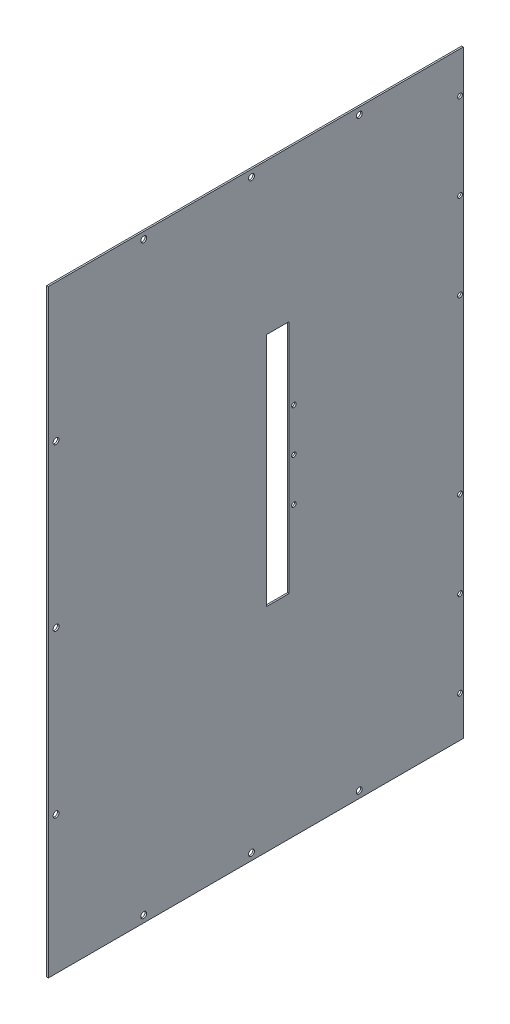
ISO-10303-21;
HEADER;
FILE_DESCRIPTION(('STEP AP214'),'2;1');
FILE_NAME('part.step','',(''),(''),'','','');
FILE_SCHEMA(('AUTOMOTIVE_DESIGN { 1 0 10303 214 1 1 1 1 }'));
ENDSEC;
DATA;
#1=APPLICATION_CONTEXT('core data for automotive mechanical design processes');
#2=APPLICATION_PROTOCOL_DEFINITION('international standard','automotive_design',2000,#1);
#3=PRODUCT_CONTEXT('',#1,'mechanical');
#4=PRODUCT('Part','Part','',(#3));
#5=PRODUCT_RELATED_PRODUCT_CATEGORY('part','',(#4));
#6=PRODUCT_DEFINITION_FORMATION('','',#4);
#7=PRODUCT_DEFINITION_CONTEXT('part definition',#1,'design');
#8=PRODUCT_DEFINITION('design','',#6,#7);
#9=PRODUCT_DEFINITION_SHAPE('','',#8);
#10=(LENGTH_UNIT() NAMED_UNIT(*) SI_UNIT(.MILLI.,.METRE.));
#11=(NAMED_UNIT(*) PLANE_ANGLE_UNIT() SI_UNIT($,.RADIAN.));
#12=(NAMED_UNIT(*) SI_UNIT($,.STERADIAN.) SOLID_ANGLE_UNIT());
#13=UNCERTAINTY_MEASURE_WITH_UNIT(LENGTH_MEASURE(1.E-05),#10,'distance_accuracy_value','');
#14=(GEOMETRIC_REPRESENTATION_CONTEXT(3) GLOBAL_UNCERTAINTY_ASSIGNED_CONTEXT((#13)) GLOBAL_UNIT_ASSIGNED_CONTEXT((#10,
#11,#12)) REPRESENTATION_CONTEXT('',''));
#15=CARTESIAN_POINT('',(0.,0.,0.));
#16=DIRECTION('',(0.,0.,1.));
#17=DIRECTION('',(1.,0.,0.));
#18=AXIS2_PLACEMENT_3D('',#15,#16,#17);
#19=CARTESIAN_POINT('',(0.,415.77191042894,0.));
#20=DIRECTION('',(0.,1.,0.));
#21=DIRECTION('',(0.,0.,1.));
#22=AXIS2_PLACEMENT_3D('',#19,#20,#21);
#23=PLANE('',#22);
#24=DIRECTION('',(1.,0.,0.));
#25=VECTOR('',#24,1.);
#26=CARTESIAN_POINT('',(0.,415.77191042894,182.444591823564));
#27=LINE('',#26,#25);
#28=CARTESIAN_POINT('',(0.,415.77191042894,182.444591823564));
#29=VERTEX_POINT('',#28);
#30=CARTESIAN_POINT('',(1.5,415.77191042894,182.444591823564));
#31=VERTEX_POINT('',#30);
#32=EDGE_CURVE('E57',#29,#31,#27,.T.);
#33=ORIENTED_EDGE('',*,*,#32,.F.);
#34=DIRECTION('',(0.,0.,-1.));
#35=VECTOR('',#34,1.);
#36=CARTESIAN_POINT('',(0.,415.77191042894,202.444591823564));
#37=LINE('',#36,#35);
#38=CARTESIAN_POINT('',(0.,415.77191042894,161.78137888322));
#39=VERTEX_POINT('',#38);
#40=EDGE_CURVE('E127',#29,#39,#37,.T.);
#41=ORIENTED_EDGE('',*,*,#40,.T.);
#42=DIRECTION('',(1.,0.,0.));
#43=VECTOR('',#42,1.);
#44=CARTESIAN_POINT('',(1.5,415.77191042894,161.78137888322));
#45=LINE('',#44,#43);
#46=CARTESIAN_POINT('',(1.5,415.77191042894,161.78137888322));
#47=VERTEX_POINT('',#46);
#48=EDGE_CURVE('E142',#39,#47,#45,.T.);
#49=ORIENTED_EDGE('',*,*,#48,.T.);
#50=DIRECTION('',(0.,0.,1.));
#51=VECTOR('',#50,1.);
#52=CARTESIAN_POINT('',(1.5,415.77191042894,202.444591823564));
#53=LINE('',#52,#51);
#54=EDGE_CURVE('E62',#47,#31,#53,.T.);
#55=ORIENTED_EDGE('',*,*,#54,.T.);
#56=EDGE_LOOP('',(#33,#41,#49,#55));
#57=FACE_BOUND('',#56,.T.);
#58=ADVANCED_FACE('F40',(#57),#23,.F.);
#59=CARTESIAN_POINT('',(0.,197.269383238865,0.));
#60=DIRECTION('',(0.,-1.,0.));
#61=DIRECTION('',(0.,0.,-1.));
#62=AXIS2_PLACEMENT_3D('',#59,#60,#61);
#63=PLANE('',#62);
#64=DIRECTION('',(-1.,0.,0.));
#65=VECTOR('',#64,1.);
#66=CARTESIAN_POINT('',(0.,197.269383238865,182.444591823564));
#67=LINE('',#66,#65);
#68=CARTESIAN_POINT('',(1.5,197.269383238865,182.444591823564));
#69=VERTEX_POINT('',#68);
#70=CARTESIAN_POINT('',(0.,197.269383238865,182.444591823564));
#71=VERTEX_POINT('',#70);
#72=EDGE_CURVE('E108',#69,#71,#67,.T.);
#73=ORIENTED_EDGE('',*,*,#72,.F.);
#74=DIRECTION('',(0.,0.,-1.));
#75=VECTOR('',#74,1.);
#76=CARTESIAN_POINT('',(1.5,197.269383238865,161.78137888322));
#77=LINE('',#76,#75);
#78=CARTESIAN_POINT('',(1.5,197.269383238865,161.78137888322));
#79=VERTEX_POINT('',#78);
#80=EDGE_CURVE('E123',#69,#79,#77,.T.);
#81=ORIENTED_EDGE('',*,*,#80,.T.);
#82=DIRECTION('',(-1.,0.,0.));
#83=VECTOR('',#82,1.);
#84=CARTESIAN_POINT('',(1.5,197.269383238865,161.78137888322));
#85=LINE('',#84,#83);
#86=CARTESIAN_POINT('',(0.,197.269383238865,161.78137888322));
#87=VERTEX_POINT('',#86);
#88=EDGE_CURVE('E111',#79,#87,#85,.T.);
#89=ORIENTED_EDGE('',*,*,#88,.T.);
#90=DIRECTION('',(0.,0.,1.));
#91=VECTOR('',#90,1.);
#92=CARTESIAN_POINT('',(0.,197.269383238865,161.78137888322));
#93=LINE('',#92,#91);
#94=EDGE_CURVE('E105',#87,#71,#93,.T.);
#95=ORIENTED_EDGE('',*,*,#94,.T.);
#96=EDGE_LOOP('',(#73,#81,#89,#95));
#97=FACE_BOUND('',#96,.T.);
#98=ADVANCED_FACE('F107',(#97),#63,.F.);
#99=CARTESIAN_POINT('',(0.,0.,161.78137888322));
#100=DIRECTION('',(0.,0.,-1.));
#101=DIRECTION('',(-1.,0.,0.));
#102=AXIS2_PLACEMENT_3D('',#99,#100,#101);
#103=PLANE('',#102);
#104=ORIENTED_EDGE('',*,*,#88,.F.);
#105=DIRECTION('',(0.,1.,0.));
#106=VECTOR('',#105,1.);
#107=CARTESIAN_POINT('',(1.5,435.77191042894,161.78137888322));
#108=LINE('',#107,#106);
#109=EDGE_CURVE('E144',#79,#47,#108,.T.);
#110=ORIENTED_EDGE('',*,*,#109,.T.);
#111=ORIENTED_EDGE('',*,*,#48,.F.);
#112=DIRECTION('',(0.,-1.,0.));
#113=VECTOR('',#112,1.);
#114=CARTESIAN_POINT('',(0.,435.77191042894,161.78137888322));
#115=LINE('',#114,#113);
#116=EDGE_CURVE('E146',#39,#87,#115,.T.);
#117=ORIENTED_EDGE('',*,*,#116,.T.);
#118=EDGE_LOOP('',(#104,#110,#111,#117));
#119=FACE_BOUND('',#118,.T.);
#120=ADVANCED_FACE('F284',(#119),#103,.F.);
#121=CARTESIAN_POINT('',(1.5,0.,385.));
#122=DIRECTION('',(-1.,0.,0.));
#123=DIRECTION('',(0.,0.,1.));
#124=AXIS2_PLACEMENT_3D('',#121,#122,#123);
#125=PLANE('',#124);
#126=CARTESIAN_POINT('',(1.5,306.533399999984,157.143238189676));
#127=DIRECTION('',(1.,0.,0.));
#128=DIRECTION('',(0.,0.,-1.));
#129=AXIS2_PLACEMENT_3D('',#126,#127,#128);
#130=CIRCLE('',#129,2.09999999999999);
#131=CARTESIAN_POINT('',(1.5,306.533399999984,155.043238189676));
#132=VERTEX_POINT('',#131);
#133=EDGE_CURVE('E213',#132,#132,#130,.T.);
#134=ORIENTED_EDGE('',*,*,#133,.F.);
#135=EDGE_LOOP('',(#134));
#136=FACE_BOUND('',#135,.T.);
#137=CARTESIAN_POINT('',(1.5,346.533399999984,157.143238189676));
#138=DIRECTION('',(1.,0.,0.));
#139=DIRECTION('',(0.,0.,-1.));
#140=AXIS2_PLACEMENT_3D('',#137,#138,#139);
#141=CIRCLE('',#140,2.09999999999999);
#142=CARTESIAN_POINT('',(1.5,346.533399999984,155.043238189676));
#143=VERTEX_POINT('',#142);
#144=EDGE_CURVE('E218',#143,#143,#141,.T.);
#145=ORIENTED_EDGE('',*,*,#144,.F.);
#146=EDGE_LOOP('',(#145));
#147=FACE_BOUND('',#146,.T.);
#148=CARTESIAN_POINT('',(1.5,266.533399999984,157.143238189676));
#149=DIRECTION('',(1.,0.,0.));
#150=DIRECTION('',(0.,0.,-1.));
#151=AXIS2_PLACEMENT_3D('',#148,#149,#150);
#152=CIRCLE('',#151,2.09999999999999);
#153=CARTESIAN_POINT('',(1.5,266.533399999984,155.043238189676));
#154=VERTEX_POINT('',#153);
#155=EDGE_CURVE('E210',#154,#154,#152,.T.);
#156=ORIENTED_EDGE('',*,*,#155,.F.);
#157=EDGE_LOOP('',(#156));
#158=FACE_BOUND('',#157,.T.);
#159=CARTESIAN_POINT('',(1.5,437.85,3.00000000000001));
#160=DIRECTION('',(-1.,0.,0.));
#161=DIRECTION('',(0.,0.,1.));
#162=AXIS2_PLACEMENT_3D('',#159,#160,#161);
#163=CIRCLE('',#162,2.25);
#164=CARTESIAN_POINT('',(1.5,437.85,5.25000000000002));
#165=VERTEX_POINT('',#164);
#166=EDGE_CURVE('E253',#165,#165,#163,.T.);
#167=ORIENTED_EDGE('',*,*,#166,.T.);
#168=EDGE_LOOP('',(#167));
#169=FACE_BOUND('',#168,.T.);
#170=CARTESIAN_POINT('',(1.5,357.85,3.00000000000002));
#171=DIRECTION('',(-1.,0.,0.));
#172=DIRECTION('',(0.,0.,1.));
#173=AXIS2_PLACEMENT_3D('',#170,#171,#172);
#174=CIRCLE('',#173,2.25000000000001);
#175=CARTESIAN_POINT('',(1.5,357.85,5.25000000000003));
#176=VERTEX_POINT('',#175);
#177=EDGE_CURVE('E250',#176,#176,#174,.T.);
#178=ORIENTED_EDGE('',*,*,#177,.T.);
#179=EDGE_LOOP('',(#178));
#180=FACE_BOUND('',#179,.T.);
#181=CARTESIAN_POINT('',(1.5,37.8500000000001,3.));
#182=DIRECTION('',(-1.,0.,0.));
#183=DIRECTION('',(0.,0.,1.));
#184=AXIS2_PLACEMENT_3D('',#181,#182,#183);
#185=CIRCLE('',#184,2.24999999999999);
#186=CARTESIAN_POINT('',(1.5,37.8500000000001,5.24999999999999));
#187=VERTEX_POINT('',#186);
#188=EDGE_CURVE('E247',#187,#187,#185,.T.);
#189=ORIENTED_EDGE('',*,*,#188,.T.);
#190=EDGE_LOOP('',(#189));
#191=FACE_BOUND('',#190,.T.);
#192=CARTESIAN_POINT('',(1.5,117.85,3.00000000000001));
#193=DIRECTION('',(-1.,0.,0.));
#194=DIRECTION('',(0.,0.,1.));
#195=AXIS2_PLACEMENT_3D('',#192,#193,#194);
#196=CIRCLE('',#195,2.25);
#197=CARTESIAN_POINT('',(1.5,117.85,5.25000000000002));
#198=VERTEX_POINT('',#197);
#199=EDGE_CURVE('E244',#198,#198,#196,.T.);
#200=ORIENTED_EDGE('',*,*,#199,.T.);
#201=EDGE_LOOP('',(#200));
#202=FACE_BOUND('',#201,.T.);
#203=CARTESIAN_POINT('',(1.5,197.85,3.00000000000002));
#204=DIRECTION('',(-1.,0.,0.));
#205=DIRECTION('',(0.,0.,1.));
#206=AXIS2_PLACEMENT_3D('',#203,#204,#205);
#207=CIRCLE('',#206,2.25000000000001);
#208=CARTESIAN_POINT('',(1.5,197.85,5.25000000000003));
#209=VERTEX_POINT('',#208);
#210=EDGE_CURVE('E230',#209,#209,#207,.T.);
#211=ORIENTED_EDGE('',*,*,#210,.T.);
#212=EDGE_LOOP('',(#211));
#213=FACE_BOUND('',#212,.T.);
#214=CARTESIAN_POINT('',(1.5,517.85,3.));
#215=DIRECTION('',(-1.,0.,0.));
#216=DIRECTION('',(0.,0.,1.));
#217=AXIS2_PLACEMENT_3D('',#214,#215,#216);
#218=CIRCLE('',#217,2.24999999999999);
#219=CARTESIAN_POINT('',(1.5,517.85,5.24999999999999));
#220=VERTEX_POINT('',#219);
#221=EDGE_CURVE('E259',#220,#220,#218,.T.);
#222=ORIENTED_EDGE('',*,*,#221,.T.);
#223=EDGE_LOOP('',(#222));
#224=FACE_BOUND('',#223,.T.);
#225=CARTESIAN_POINT('',(1.5,549.318299999998,196.5));
#226=DIRECTION('',(1.,0.,0.));
#227=DIRECTION('',(0.,0.,-1.));
#228=AXIS2_PLACEMENT_3D('',#225,#226,#227);
#229=CIRCLE('',#228,2.74999999999999);
#230=CARTESIAN_POINT('',(1.5,549.318299999998,193.75));
#231=VERTEX_POINT('',#230);
#232=EDGE_CURVE('E204',#231,#231,#229,.T.);
#233=ORIENTED_EDGE('',*,*,#232,.F.);
#234=EDGE_LOOP('',(#233));
#235=FACE_BOUND('',#234,.T.);
#236=CARTESIAN_POINT('',(1.5,549.318299999998,96.5000000000001));
#237=DIRECTION('',(1.,0.,0.));
#238=DIRECTION('',(0.,0.,-1.));
#239=AXIS2_PLACEMENT_3D('',#236,#237,#238);
#240=CIRCLE('',#239,2.74999999999995);
#241=CARTESIAN_POINT('',(1.5,549.318299999998,93.7500000000001));
#242=VERTEX_POINT('',#241);
#243=EDGE_CURVE('E262',#242,#242,#240,.T.);
#244=ORIENTED_EDGE('',*,*,#243,.F.);
#245=EDGE_LOOP('',(#244));
#246=FACE_BOUND('',#245,.T.);
#247=CARTESIAN_POINT('',(1.5,549.318299999998,296.5));
#248=DIRECTION('',(1.,0.,0.));
#249=DIRECTION('',(0.,0.,-1.));
#250=AXIS2_PLACEMENT_3D('',#247,#248,#249);
#251=CIRCLE('',#250,2.74999999999991);
#252=CARTESIAN_POINT('',(1.5,549.318299999998,293.75));
#253=VERTEX_POINT('',#252);
#254=EDGE_CURVE('E199',#253,#253,#251,.T.);
#255=ORIENTED_EDGE('',*,*,#254,.F.);
#256=EDGE_LOOP('',(#255));
#257=FACE_BOUND('',#256,.T.);
#258=CARTESIAN_POINT('',(1.5,277.848399999997,377.815462169057));
#259=DIRECTION('',(1.,0.,0.));
#260=DIRECTION('',(0.,0.,-1.));
#261=AXIS2_PLACEMENT_3D('',#258,#259,#260);
#262=CIRCLE('',#261,2.75000000000004);
#263=CARTESIAN_POINT('',(1.5,277.848399999997,375.065462169057));
#264=VERTEX_POINT('',#263);
#265=EDGE_CURVE('E192',#264,#264,#262,.T.);
#266=ORIENTED_EDGE('',*,*,#265,.F.);
#267=EDGE_LOOP('',(#266));
#268=FACE_BOUND('',#267,.T.);
#269=CARTESIAN_POINT('',(1.5,427.848399999997,377.815462169057));
#270=DIRECTION('',(1.,0.,0.));
#271=DIRECTION('',(0.,0.,-1.));
#272=AXIS2_PLACEMENT_3D('',#269,#270,#271);
#273=CIRCLE('',#272,2.74999999999993);
#274=CARTESIAN_POINT('',(1.5,427.848399999997,375.065462169057));
#275=VERTEX_POINT('',#274);
#276=EDGE_CURVE('E198',#275,#275,#273,.T.);
#277=ORIENTED_EDGE('',*,*,#276,.F.);
#278=EDGE_LOOP('',(#277));
#279=FACE_BOUND('',#278,.T.);
#280=CARTESIAN_POINT('',(1.5,127.848399999997,377.815462169058));
#281=DIRECTION('',(1.,0.,0.));
#282=DIRECTION('',(0.,0.,-1.));
#283=AXIS2_PLACEMENT_3D('',#280,#281,#282);
#284=CIRCLE('',#283,2.75000000000004);
#285=CARTESIAN_POINT('',(1.5,127.848399999997,375.065462169058));
#286=VERTEX_POINT('',#285);
#287=EDGE_CURVE('E187',#286,#286,#284,.T.);
#288=ORIENTED_EDGE('',*,*,#287,.F.);
#289=EDGE_LOOP('',(#288));
#290=FACE_BOUND('',#289,.T.);
#291=CARTESIAN_POINT('',(1.5,6.38169999999832,196.5));
#292=DIRECTION('',(1.,0.,0.));
#293=DIRECTION('',(0.,0.,-1.));
#294=AXIS2_PLACEMENT_3D('',#291,#292,#293);
#295=CIRCLE('',#294,2.75000000000001);
#296=CARTESIAN_POINT('',(1.5,6.38169999999832,193.75));
#297=VERTEX_POINT('',#296);
#298=EDGE_CURVE('E180',#297,#297,#295,.T.);
#299=ORIENTED_EDGE('',*,*,#298,.F.);
#300=EDGE_LOOP('',(#299));
#301=FACE_BOUND('',#300,.T.);
#302=CARTESIAN_POINT('',(1.5,6.38169999999831,96.5));
#303=DIRECTION('',(1.,0.,0.));
#304=DIRECTION('',(0.,0.,-1.));
#305=AXIS2_PLACEMENT_3D('',#302,#303,#304);
#306=CIRCLE('',#305,2.75000000000001);
#307=CARTESIAN_POINT('',(1.5,6.38169999999831,93.75));
#308=VERTEX_POINT('',#307);
#309=EDGE_CURVE('E186',#308,#308,#306,.T.);
#310=ORIENTED_EDGE('',*,*,#309,.F.);
#311=EDGE_LOOP('',(#310));
#312=FACE_BOUND('',#311,.T.);
#313=CARTESIAN_POINT('',(1.5,6.38169999999827,296.5));
#314=DIRECTION('',(1.,0.,0.));
#315=DIRECTION('',(0.,0.,-1.));
#316=AXIS2_PLACEMENT_3D('',#313,#314,#315);
#317=CIRCLE('',#316,2.75000000000004);
#318=CARTESIAN_POINT('',(1.5,6.38169999999827,293.75));
#319=VERTEX_POINT('',#318);
#320=EDGE_CURVE('E132',#319,#319,#317,.T.);
#321=ORIENTED_EDGE('',*,*,#320,.F.);
#322=EDGE_LOOP('',(#321));
#323=FACE_BOUND('',#322,.T.);
#324=ORIENTED_EDGE('',*,*,#109,.F.);
#325=ORIENTED_EDGE('',*,*,#80,.F.);
#326=DIRECTION('',(0.,-1.,0.));
#327=VECTOR('',#326,1.);
#328=CARTESIAN_POINT('',(1.5,415.77191042894,182.444591823564));
#329=LINE('',#328,#327);
#330=EDGE_CURVE('E122',#31,#69,#329,.T.);
#331=ORIENTED_EDGE('',*,*,#330,.F.);
#332=ORIENTED_EDGE('',*,*,#54,.F.);
#333=EDGE_LOOP('',(#324,#325,#331,#332));
#334=FACE_BOUND('',#333,.T.);
#335=DIRECTION('',(0.,1.,0.));
#336=VECTOR('',#335,1.);
#337=CARTESIAN_POINT('',(1.5,0.,0.));
#338=LINE('',#337,#336);
#339=CARTESIAN_POINT('',(1.5,0.,0.));
#340=VERTEX_POINT('',#339);
#341=CARTESIAN_POINT('',(1.5,555.7,0.));
#342=VERTEX_POINT('',#341);
#343=EDGE_CURVE('E148',#340,#342,#338,.T.);
#344=ORIENTED_EDGE('',*,*,#343,.T.);
#345=DIRECTION('',(0.,0.,-1.));
#346=VECTOR('',#345,1.);
#347=CARTESIAN_POINT('',(1.5,555.7,385.));
#348=LINE('',#347,#346);
#349=CARTESIAN_POINT('',(1.5,555.7,385.));
#350=VERTEX_POINT('',#349);
#351=EDGE_CURVE('E11',#350,#342,#348,.T.);
#352=ORIENTED_EDGE('',*,*,#351,.F.);
#353=DIRECTION('',(0.,1.,0.));
#354=VECTOR('',#353,1.);
#355=CARTESIAN_POINT('',(1.5,0.,385.));
#356=LINE('',#355,#354);
#357=CARTESIAN_POINT('',(1.5,0.,385.));
#358=VERTEX_POINT('',#357);
#359=EDGE_CURVE('E149',#358,#350,#356,.T.);
#360=ORIENTED_EDGE('',*,*,#359,.F.);
#361=DIRECTION('',(0.,0.,-1.));
#362=VECTOR('',#361,1.);
#363=CARTESIAN_POINT('',(1.5,0.,385.));
#364=LINE('',#363,#362);
#365=EDGE_CURVE('E161',#358,#340,#364,.T.);
#366=ORIENTED_EDGE('',*,*,#365,.T.);
#367=EDGE_LOOP('',(#344,#352,#360,#366));
#368=FACE_BOUND('',#367,.T.);
#369=ADVANCED_FACE('F42',(#136,#147,#158,#169,#180,#191,#202,#213,#224,#235,#246,#257,#268,#279,
#290,#301,#312,#323,#334,#368),#125,.F.);
#370=CARTESIAN_POINT('',(0.,555.7,385.));
#371=DIRECTION('',(0.,1.,0.));
#372=DIRECTION('',(0.,0.,1.));
#373=AXIS2_PLACEMENT_3D('',#370,#371,#372);
#374=PLANE('',#373);
#375=DIRECTION('',(1.,0.,0.));
#376=VECTOR('',#375,1.);
#377=CARTESIAN_POINT('',(0.,555.7,0.));
#378=LINE('',#377,#376);
#379=CARTESIAN_POINT('',(0.,555.7,0.));
#380=VERTEX_POINT('',#379);
#381=EDGE_CURVE('E164',#380,#342,#378,.T.);
#382=ORIENTED_EDGE('',*,*,#381,.F.);
#383=DIRECTION('',(0.,0.,-1.));
#384=VECTOR('',#383,1.);
#385=CARTESIAN_POINT('',(0.,555.7,385.));
#386=LINE('',#385,#384);
#387=CARTESIAN_POINT('',(0.,555.7,385.));
#388=VERTEX_POINT('',#387);
#389=EDGE_CURVE('E49',#388,#380,#386,.T.);
#390=ORIENTED_EDGE('',*,*,#389,.F.);
#391=DIRECTION('',(1.,0.,0.));
#392=VECTOR('',#391,1.);
#393=CARTESIAN_POINT('',(0.,555.7,385.));
#394=LINE('',#393,#392);
#395=EDGE_CURVE('E151',#388,#350,#394,.T.);
#396=ORIENTED_EDGE('',*,*,#395,.T.);
#397=ORIENTED_EDGE('',*,*,#351,.T.);
#398=EDGE_LOOP('',(#382,#390,#396,#397));
#399=FACE_BOUND('',#398,.T.);
#400=ADVANCED_FACE('F283',(#399),#374,.T.);
#401=CARTESIAN_POINT('',(0.,0.,385.));
#402=DIRECTION('',(-1.,0.,0.));
#403=DIRECTION('',(0.,0.,1.));
#404=AXIS2_PLACEMENT_3D('',#401,#402,#403);
#405=PLANE('',#404);
#406=CARTESIAN_POINT('',(0.,306.533399999984,157.143238189676));
#407=DIRECTION('',(-1.,0.,0.));
#408=DIRECTION('',(0.,0.,1.));
#409=AXIS2_PLACEMENT_3D('',#406,#407,#408);
#410=CIRCLE('',#409,2.09999999999999);
#411=CARTESIAN_POINT('',(0.,306.533399999984,159.243238189676));
#412=VERTEX_POINT('',#411);
#413=EDGE_CURVE('E44',#412,#412,#410,.T.);
#414=ORIENTED_EDGE('',*,*,#413,.F.);
#415=EDGE_LOOP('',(#414));
#416=FACE_BOUND('',#415,.T.);
#417=CARTESIAN_POINT('',(0.,346.533399999984,157.143238189676));
#418=DIRECTION('',(-1.,0.,0.));
#419=DIRECTION('',(0.,0.,1.));
#420=AXIS2_PLACEMENT_3D('',#417,#418,#419);
#421=CIRCLE('',#420,2.09999999999999);
#422=CARTESIAN_POINT('',(0.,346.533399999984,159.243238189676));
#423=VERTEX_POINT('',#422);
#424=EDGE_CURVE('E211',#423,#423,#421,.T.);
#425=ORIENTED_EDGE('',*,*,#424,.F.);
#426=EDGE_LOOP('',(#425));
#427=FACE_BOUND('',#426,.T.);
#428=CARTESIAN_POINT('',(0.,266.533399999984,157.143238189676));
#429=DIRECTION('',(-1.,0.,0.));
#430=DIRECTION('',(0.,0.,1.));
#431=AXIS2_PLACEMENT_3D('',#428,#429,#430);
#432=CIRCLE('',#431,2.09999999999999);
#433=CARTESIAN_POINT('',(0.,266.533399999984,159.243238189676));
#434=VERTEX_POINT('',#433);
#435=EDGE_CURVE('E207',#434,#434,#432,.T.);
#436=ORIENTED_EDGE('',*,*,#435,.F.);
#437=EDGE_LOOP('',(#436));
#438=FACE_BOUND('',#437,.T.);
#439=CARTESIAN_POINT('',(0.,437.85,3.00000000000001));
#440=DIRECTION('',(-1.,0.,0.));
#441=DIRECTION('',(0.,0.,1.));
#442=AXIS2_PLACEMENT_3D('',#439,#440,#441);
#443=CIRCLE('',#442,2.25);
#444=CARTESIAN_POINT('',(0.,437.85,5.25000000000002));
#445=VERTEX_POINT('',#444);
#446=EDGE_CURVE('E227',#445,#445,#443,.T.);
#447=ORIENTED_EDGE('',*,*,#446,.F.);
#448=EDGE_LOOP('',(#447));
#449=FACE_BOUND('',#448,.T.);
#450=CARTESIAN_POINT('',(0.,357.85,3.00000000000002));
#451=DIRECTION('',(-1.,0.,0.));
#452=DIRECTION('',(0.,0.,1.));
#453=AXIS2_PLACEMENT_3D('',#450,#451,#452);
#454=CIRCLE('',#453,2.25000000000001);
#455=CARTESIAN_POINT('',(0.,357.85,5.25000000000003));
#456=VERTEX_POINT('',#455);
#457=EDGE_CURVE('E231',#456,#456,#454,.T.);
#458=ORIENTED_EDGE('',*,*,#457,.F.);
#459=EDGE_LOOP('',(#458));
#460=FACE_BOUND('',#459,.T.);
#461=CARTESIAN_POINT('',(0.,37.8500000000001,3.));
#462=DIRECTION('',(-1.,0.,0.));
#463=DIRECTION('',(0.,0.,-1.));
#464=AXIS2_PLACEMENT_3D('',#461,#462,#463);
#465=CIRCLE('',#464,2.24999999999999);
#466=CARTESIAN_POINT('',(0.,37.8500000000001,0.750000000000018));
#467=VERTEX_POINT('',#466);
#468=EDGE_CURVE('E234',#467,#467,#465,.T.);
#469=ORIENTED_EDGE('',*,*,#468,.F.);
#470=EDGE_LOOP('',(#469));
#471=FACE_BOUND('',#470,.T.);
#472=CARTESIAN_POINT('',(0.,117.85,3.00000000000001));
#473=DIRECTION('',(-1.,0.,0.));
#474=DIRECTION('',(0.,0.,-1.));
#475=AXIS2_PLACEMENT_3D('',#472,#473,#474);
#476=CIRCLE('',#475,2.25);
#477=CARTESIAN_POINT('',(0.,117.85,0.75000000000001));
#478=VERTEX_POINT('',#477);
#479=EDGE_CURVE('E237',#478,#478,#476,.T.);
#480=ORIENTED_EDGE('',*,*,#479,.F.);
#481=EDGE_LOOP('',(#480));
#482=FACE_BOUND('',#481,.T.);
#483=CARTESIAN_POINT('',(0.,197.85,3.00000000000002));
#484=DIRECTION('',(-1.,0.,0.));
#485=DIRECTION('',(0.,0.,-1.));
#486=AXIS2_PLACEMENT_3D('',#483,#484,#485);
#487=CIRCLE('',#486,2.25000000000001);
#488=CARTESIAN_POINT('',(0.,197.85,0.750000000000019));
#489=VERTEX_POINT('',#488);
#490=EDGE_CURVE('E209',#489,#489,#487,.T.);
#491=ORIENTED_EDGE('',*,*,#490,.F.);
#492=EDGE_LOOP('',(#491));
#493=FACE_BOUND('',#492,.T.);
#494=CARTESIAN_POINT('',(0.,517.85,3.));
#495=DIRECTION('',(-1.,0.,0.));
#496=DIRECTION('',(0.,0.,1.));
#497=AXIS2_PLACEMENT_3D('',#494,#495,#496);
#498=CIRCLE('',#497,2.24999999999999);
#499=CARTESIAN_POINT('',(0.,517.85,5.24999999999999));
#500=VERTEX_POINT('',#499);
#501=EDGE_CURVE('E256',#500,#500,#498,.T.);
#502=ORIENTED_EDGE('',*,*,#501,.F.);
#503=EDGE_LOOP('',(#502));
#504=FACE_BOUND('',#503,.T.);
#505=CARTESIAN_POINT('',(0.,549.318299999998,196.5));
#506=DIRECTION('',(-1.,0.,0.));
#507=DIRECTION('',(0.,0.,1.));
#508=AXIS2_PLACEMENT_3D('',#505,#506,#507);
#509=CIRCLE('',#508,2.74999999999999);
#510=CARTESIAN_POINT('',(0.,549.318299999998,199.25));
#511=VERTEX_POINT('',#510);
#512=EDGE_CURVE('E203',#511,#511,#509,.T.);
#513=ORIENTED_EDGE('',*,*,#512,.F.);
#514=EDGE_LOOP('',(#513));
#515=FACE_BOUND('',#514,.T.);
#516=CARTESIAN_POINT('',(0.,549.318299999998,96.5000000000001));
#517=DIRECTION('',(-1.,0.,0.));
#518=DIRECTION('',(0.,0.,1.));
#519=AXIS2_PLACEMENT_3D('',#516,#517,#518);
#520=CIRCLE('',#519,2.74999999999995);
#521=CARTESIAN_POINT('',(0.,549.318299999998,99.25));
#522=VERTEX_POINT('',#521);
#523=EDGE_CURVE('E200',#522,#522,#520,.T.);
#524=ORIENTED_EDGE('',*,*,#523,.F.);
#525=EDGE_LOOP('',(#524));
#526=FACE_BOUND('',#525,.T.);
#527=CARTESIAN_POINT('',(0.,549.318299999998,296.5));
#528=DIRECTION('',(-1.,0.,0.));
#529=DIRECTION('',(0.,0.,1.));
#530=AXIS2_PLACEMENT_3D('',#527,#528,#529);
#531=CIRCLE('',#530,2.74999999999991);
#532=CARTESIAN_POINT('',(0.,549.318299999998,299.25));
#533=VERTEX_POINT('',#532);
#534=EDGE_CURVE('E195',#533,#533,#531,.T.);
#535=ORIENTED_EDGE('',*,*,#534,.F.);
#536=EDGE_LOOP('',(#535));
#537=FACE_BOUND('',#536,.T.);
#538=CARTESIAN_POINT('',(0.,277.848399999997,377.815462169057));
#539=DIRECTION('',(-1.,0.,0.));
#540=DIRECTION('',(0.,0.,1.));
#541=AXIS2_PLACEMENT_3D('',#538,#539,#540);
#542=CIRCLE('',#541,2.75000000000004);
#543=CARTESIAN_POINT('',(0.,277.848399999997,380.565462169057));
#544=VERTEX_POINT('',#543);
#545=EDGE_CURVE('E191',#544,#544,#542,.T.);
#546=ORIENTED_EDGE('',*,*,#545,.F.);
#547=EDGE_LOOP('',(#546));
#548=FACE_BOUND('',#547,.T.);
#549=CARTESIAN_POINT('',(0.,427.848399999997,377.815462169057));
#550=DIRECTION('',(-1.,0.,0.));
#551=DIRECTION('',(0.,0.,1.));
#552=AXIS2_PLACEMENT_3D('',#549,#550,#551);
#553=CIRCLE('',#552,2.74999999999993);
#554=CARTESIAN_POINT('',(0.,427.848399999997,380.565462169056));
#555=VERTEX_POINT('',#554);
#556=EDGE_CURVE('E188',#555,#555,#553,.T.);
#557=ORIENTED_EDGE('',*,*,#556,.F.);
#558=EDGE_LOOP('',(#557));
#559=FACE_BOUND('',#558,.T.);
#560=CARTESIAN_POINT('',(0.,127.848399999997,377.815462169058));
#561=DIRECTION('',(-1.,0.,0.));
#562=DIRECTION('',(0.,0.,1.));
#563=AXIS2_PLACEMENT_3D('',#560,#561,#562);
#564=CIRCLE('',#563,2.75000000000004);
#565=CARTESIAN_POINT('',(0.,127.848399999997,380.565462169058));
#566=VERTEX_POINT('',#565);
#567=EDGE_CURVE('E183',#566,#566,#564,.T.);
#568=ORIENTED_EDGE('',*,*,#567,.F.);
#569=EDGE_LOOP('',(#568));
#570=FACE_BOUND('',#569,.T.);
#571=CARTESIAN_POINT('',(0.,6.38169999999832,196.5));
#572=DIRECTION('',(-1.,0.,0.));
#573=DIRECTION('',(0.,0.,1.));
#574=AXIS2_PLACEMENT_3D('',#571,#572,#573);
#575=CIRCLE('',#574,2.75000000000001);
#576=CARTESIAN_POINT('',(0.,6.38169999999832,199.25));
#577=VERTEX_POINT('',#576);
#578=EDGE_CURVE('E179',#577,#577,#575,.T.);
#579=ORIENTED_EDGE('',*,*,#578,.F.);
#580=EDGE_LOOP('',(#579));
#581=FACE_BOUND('',#580,.T.);
#582=CARTESIAN_POINT('',(0.,6.38169999999831,96.5));
#583=DIRECTION('',(-1.,0.,0.));
#584=DIRECTION('',(0.,0.,1.));
#585=AXIS2_PLACEMENT_3D('',#582,#583,#584);
#586=CIRCLE('',#585,2.75000000000001);
#587=CARTESIAN_POINT('',(0.,6.38169999999831,99.25));
#588=VERTEX_POINT('',#587);
#589=EDGE_CURVE('E176',#588,#588,#586,.T.);
#590=ORIENTED_EDGE('',*,*,#589,.F.);
#591=EDGE_LOOP('',(#590));
#592=FACE_BOUND('',#591,.T.);
#593=CARTESIAN_POINT('',(0.,6.38169999999827,296.5));
#594=DIRECTION('',(-1.,0.,0.));
#595=DIRECTION('',(0.,0.,1.));
#596=AXIS2_PLACEMENT_3D('',#593,#594,#595);
#597=CIRCLE('',#596,2.75000000000004);
#598=CARTESIAN_POINT('',(0.,6.38169999999827,299.25));
#599=VERTEX_POINT('',#598);
#600=EDGE_CURVE('E128',#599,#599,#597,.T.);
#601=ORIENTED_EDGE('',*,*,#600,.F.);
#602=EDGE_LOOP('',(#601));
#603=FACE_BOUND('',#602,.T.);
#604=ORIENTED_EDGE('',*,*,#40,.F.);
#605=DIRECTION('',(0.,1.,0.));
#606=VECTOR('',#605,1.);
#607=CARTESIAN_POINT('',(0.,415.77191042894,182.444591823564));
#608=LINE('',#607,#606);
#609=EDGE_CURVE('E120',#71,#29,#608,.T.);
#610=ORIENTED_EDGE('',*,*,#609,.F.);
#611=ORIENTED_EDGE('',*,*,#94,.F.);
#612=ORIENTED_EDGE('',*,*,#116,.F.);
#613=EDGE_LOOP('',(#604,#610,#611,#612));
#614=FACE_BOUND('',#613,.T.);
#615=DIRECTION('',(0.,1.,0.));
#616=VECTOR('',#615,1.);
#617=CARTESIAN_POINT('',(0.,0.,0.));
#618=LINE('',#617,#616);
#619=CARTESIAN_POINT('',(0.,0.,0.));
#620=VERTEX_POINT('',#619);
#621=EDGE_CURVE('E167',#620,#380,#618,.T.);
#622=ORIENTED_EDGE('',*,*,#621,.F.);
#623=DIRECTION('',(0.,0.,-1.));
#624=VECTOR('',#623,1.);
#625=CARTESIAN_POINT('',(0.,0.,385.));
#626=LINE('',#625,#624);
#627=CARTESIAN_POINT('',(0.,0.,385.));
#628=VERTEX_POINT('',#627);
#629=EDGE_CURVE('E173',#628,#620,#626,.T.);
#630=ORIENTED_EDGE('',*,*,#629,.F.);
#631=DIRECTION('',(0.,1.,0.));
#632=VECTOR('',#631,1.);
#633=CARTESIAN_POINT('',(0.,0.,385.));
#634=LINE('',#633,#632);
#635=EDGE_CURVE('E155',#628,#388,#634,.T.);
#636=ORIENTED_EDGE('',*,*,#635,.T.);
#637=ORIENTED_EDGE('',*,*,#389,.T.);
#638=EDGE_LOOP('',(#622,#630,#636,#637));
#639=FACE_BOUND('',#638,.T.);
#640=ADVANCED_FACE('F125',(#416,#427,#438,#449,#460,#471,#482,#493,#504,#515,#526,#537,#548,
#559,#570,#581,#592,#603,#614,#639),#405,.T.);
#641=CARTESIAN_POINT('',(1.5,0.,385.));
#642=DIRECTION('',(0.,-1.,0.));
#643=DIRECTION('',(0.,0.,-1.));
#644=AXIS2_PLACEMENT_3D('',#641,#642,#643);
#645=PLANE('',#644);
#646=DIRECTION('',(-1.,0.,0.));
#647=VECTOR('',#646,1.);
#648=CARTESIAN_POINT('',(1.5,0.,0.));
#649=LINE('',#648,#647);
#650=EDGE_CURVE('E152',#340,#620,#649,.T.);
#651=ORIENTED_EDGE('',*,*,#650,.F.);
#652=ORIENTED_EDGE('',*,*,#365,.F.);
#653=DIRECTION('',(-1.,0.,0.));
#654=VECTOR('',#653,1.);
#655=CARTESIAN_POINT('',(1.5,0.,385.));
#656=LINE('',#655,#654);
#657=EDGE_CURVE('E158',#358,#628,#656,.T.);
#658=ORIENTED_EDGE('',*,*,#657,.T.);
#659=ORIENTED_EDGE('',*,*,#629,.T.);
#660=EDGE_LOOP('',(#651,#652,#658,#659));
#661=FACE_BOUND('',#660,.T.);
#662=ADVANCED_FACE('F306',(#661),#645,.T.);
#663=CARTESIAN_POINT('',(0.,0.,385.));
#664=DIRECTION('',(0.,0.,-1.));
#665=DIRECTION('',(-1.,0.,0.));
#666=AXIS2_PLACEMENT_3D('',#663,#664,#665);
#667=PLANE('',#666);
#668=ORIENTED_EDGE('',*,*,#359,.T.);
#669=ORIENTED_EDGE('',*,*,#395,.F.);
#670=ORIENTED_EDGE('',*,*,#635,.F.);
#671=ORIENTED_EDGE('',*,*,#657,.F.);
#672=EDGE_LOOP('',(#668,#669,#670,#671));
#673=FACE_BOUND('',#672,.T.);
#674=ADVANCED_FACE('F303',(#673),#667,.F.);
#675=CARTESIAN_POINT('',(0.,0.,0.));
#676=DIRECTION('',(0.,0.,-1.));
#677=DIRECTION('',(-1.,0.,0.));
#678=AXIS2_PLACEMENT_3D('',#675,#676,#677);
#679=PLANE('',#678);
#680=ORIENTED_EDGE('',*,*,#343,.F.);
#681=ORIENTED_EDGE('',*,*,#650,.T.);
#682=ORIENTED_EDGE('',*,*,#621,.T.);
#683=ORIENTED_EDGE('',*,*,#381,.T.);
#684=EDGE_LOOP('',(#680,#681,#682,#683));
#685=FACE_BOUND('',#684,.T.);
#686=ADVANCED_FACE('F297',(#685),#679,.T.);
#687=CARTESIAN_POINT('',(0.,0.,182.444591823564));
#688=DIRECTION('',(0.,0.,1.));
#689=DIRECTION('',(1.,0.,0.));
#690=AXIS2_PLACEMENT_3D('',#687,#688,#689);
#691=PLANE('',#690);
#692=ORIENTED_EDGE('',*,*,#609,.T.);
#693=ORIENTED_EDGE('',*,*,#32,.T.);
#694=ORIENTED_EDGE('',*,*,#330,.T.);
#695=ORIENTED_EDGE('',*,*,#72,.T.);
#696=EDGE_LOOP('',(#692,#693,#694,#695));
#697=FACE_BOUND('',#696,.T.);
#698=ADVANCED_FACE('F119',(#697),#691,.F.);
#699=CARTESIAN_POINT('',(-18.5,6.38169999999827,296.5));
#700=DIRECTION('',(1.,0.,0.));
#701=DIRECTION('',(0.,0.,-1.));
#702=AXIS2_PLACEMENT_3D('',#699,#700,#701);
#703=CYLINDRICAL_SURFACE('',#702,2.75000000000004);
#704=ORIENTED_EDGE('',*,*,#600,.T.);
#705=EDGE_LOOP('',(#704));
#706=FACE_BOUND('',#705,.T.);
#707=ORIENTED_EDGE('',*,*,#320,.T.);
#708=EDGE_LOOP('',(#707));
#709=FACE_BOUND('',#708,.T.);
#710=ADVANCED_FACE('F332',(#706,#709),#703,.F.);
#711=CARTESIAN_POINT('',(-18.5,6.38169999999831,96.5));
#712=DIRECTION('',(1.,0.,0.));
#713=DIRECTION('',(0.,0.,-1.));
#714=AXIS2_PLACEMENT_3D('',#711,#712,#713);
#715=CYLINDRICAL_SURFACE('',#714,2.75000000000001);
#716=ORIENTED_EDGE('',*,*,#589,.T.);
#717=EDGE_LOOP('',(#716));
#718=FACE_BOUND('',#717,.T.);
#719=ORIENTED_EDGE('',*,*,#309,.T.);
#720=EDGE_LOOP('',(#719));
#721=FACE_BOUND('',#720,.T.);
#722=ADVANCED_FACE('F279',(#718,#721),#715,.F.);
#723=CARTESIAN_POINT('',(-18.5,6.38169999999832,196.5));
#724=DIRECTION('',(1.,0.,0.));
#725=DIRECTION('',(0.,0.,-1.));
#726=AXIS2_PLACEMENT_3D('',#723,#724,#725);
#727=CYLINDRICAL_SURFACE('',#726,2.75000000000001);
#728=ORIENTED_EDGE('',*,*,#578,.T.);
#729=EDGE_LOOP('',(#728));
#730=FACE_BOUND('',#729,.T.);
#731=ORIENTED_EDGE('',*,*,#298,.T.);
#732=EDGE_LOOP('',(#731));
#733=FACE_BOUND('',#732,.T.);
#734=ADVANCED_FACE('F342',(#730,#733),#727,.F.);
#735=CARTESIAN_POINT('',(-8.5,127.848399999997,377.815462169058));
#736=DIRECTION('',(1.,0.,0.));
#737=DIRECTION('',(0.,0.,-1.));
#738=AXIS2_PLACEMENT_3D('',#735,#736,#737);
#739=CYLINDRICAL_SURFACE('',#738,2.75000000000004);
#740=ORIENTED_EDGE('',*,*,#567,.T.);
#741=EDGE_LOOP('',(#740));
#742=FACE_BOUND('',#741,.T.);
#743=ORIENTED_EDGE('',*,*,#287,.T.);
#744=EDGE_LOOP('',(#743));
#745=FACE_BOUND('',#744,.T.);
#746=ADVANCED_FACE('F346',(#742,#745),#739,.F.);
#747=CARTESIAN_POINT('',(-8.5,427.848399999997,377.815462169057));
#748=DIRECTION('',(1.,0.,0.));
#749=DIRECTION('',(0.,0.,-1.));
#750=AXIS2_PLACEMENT_3D('',#747,#748,#749);
#751=CYLINDRICAL_SURFACE('',#750,2.74999999999993);
#752=ORIENTED_EDGE('',*,*,#556,.T.);
#753=EDGE_LOOP('',(#752));
#754=FACE_BOUND('',#753,.T.);
#755=ORIENTED_EDGE('',*,*,#276,.T.);
#756=EDGE_LOOP('',(#755));
#757=FACE_BOUND('',#756,.T.);
#758=ADVANCED_FACE('F350',(#754,#757),#751,.F.);
#759=CARTESIAN_POINT('',(-8.5,277.848399999997,377.815462169057));
#760=DIRECTION('',(1.,0.,0.));
#761=DIRECTION('',(0.,0.,-1.));
#762=AXIS2_PLACEMENT_3D('',#759,#760,#761);
#763=CYLINDRICAL_SURFACE('',#762,2.75000000000004);
#764=ORIENTED_EDGE('',*,*,#545,.T.);
#765=EDGE_LOOP('',(#764));
#766=FACE_BOUND('',#765,.T.);
#767=ORIENTED_EDGE('',*,*,#265,.T.);
#768=EDGE_LOOP('',(#767));
#769=FACE_BOUND('',#768,.T.);
#770=ADVANCED_FACE('F354',(#766,#769),#763,.F.);
#771=CARTESIAN_POINT('',(-8.5,549.318299999998,296.5));
#772=DIRECTION('',(1.,0.,0.));
#773=DIRECTION('',(0.,0.,-1.));
#774=AXIS2_PLACEMENT_3D('',#771,#772,#773);
#775=CYLINDRICAL_SURFACE('',#774,2.74999999999991);
#776=ORIENTED_EDGE('',*,*,#534,.T.);
#777=EDGE_LOOP('',(#776));
#778=FACE_BOUND('',#777,.T.);
#779=ORIENTED_EDGE('',*,*,#254,.T.);
#780=EDGE_LOOP('',(#779));
#781=FACE_BOUND('',#780,.T.);
#782=ADVANCED_FACE('F358',(#778,#781),#775,.F.);
#783=CARTESIAN_POINT('',(-8.5,549.318299999998,96.5000000000001));
#784=DIRECTION('',(1.,0.,0.));
#785=DIRECTION('',(0.,0.,-1.));
#786=AXIS2_PLACEMENT_3D('',#783,#784,#785);
#787=CYLINDRICAL_SURFACE('',#786,2.74999999999995);
#788=ORIENTED_EDGE('',*,*,#523,.T.);
#789=EDGE_LOOP('',(#788));
#790=FACE_BOUND('',#789,.T.);
#791=ORIENTED_EDGE('',*,*,#243,.T.);
#792=EDGE_LOOP('',(#791));
#793=FACE_BOUND('',#792,.T.);
#794=ADVANCED_FACE('F362',(#790,#793),#787,.F.);
#795=CARTESIAN_POINT('',(-8.5,549.318299999998,196.5));
#796=DIRECTION('',(1.,0.,0.));
#797=DIRECTION('',(0.,0.,-1.));
#798=AXIS2_PLACEMENT_3D('',#795,#796,#797);
#799=CYLINDRICAL_SURFACE('',#798,2.74999999999999);
#800=ORIENTED_EDGE('',*,*,#512,.T.);
#801=EDGE_LOOP('',(#800));
#802=FACE_BOUND('',#801,.T.);
#803=ORIENTED_EDGE('',*,*,#232,.T.);
#804=EDGE_LOOP('',(#803));
#805=FACE_BOUND('',#804,.T.);
#806=ADVANCED_FACE('F366',(#802,#805),#799,.F.);
#807=CARTESIAN_POINT('',(10.,517.85,3.));
#808=DIRECTION('',(-1.,0.,0.));
#809=DIRECTION('',(0.,0.,1.));
#810=AXIS2_PLACEMENT_3D('',#807,#808,#809);
#811=CYLINDRICAL_SURFACE('',#810,2.24999999999999);
#812=ORIENTED_EDGE('',*,*,#501,.T.);
#813=EDGE_LOOP('',(#812));
#814=FACE_BOUND('',#813,.T.);
#815=ORIENTED_EDGE('',*,*,#221,.F.);
#816=EDGE_LOOP('',(#815));
#817=FACE_BOUND('',#816,.T.);
#818=ADVANCED_FACE('F370',(#814,#817),#811,.F.);
#819=CARTESIAN_POINT('',(10.,197.85,3.00000000000002));
#820=DIRECTION('',(-1.,0.,0.));
#821=DIRECTION('',(0.,0.,1.));
#822=AXIS2_PLACEMENT_3D('',#819,#820,#821);
#823=CYLINDRICAL_SURFACE('',#822,2.25000000000001);
#824=ORIENTED_EDGE('',*,*,#490,.T.);
#825=EDGE_LOOP('',(#824));
#826=FACE_BOUND('',#825,.T.);
#827=ORIENTED_EDGE('',*,*,#210,.F.);
#828=EDGE_LOOP('',(#827));
#829=FACE_BOUND('',#828,.T.);
#830=ADVANCED_FACE('F374',(#826,#829),#823,.F.);
#831=CARTESIAN_POINT('',(10.,117.85,3.00000000000001));
#832=DIRECTION('',(-1.,0.,0.));
#833=DIRECTION('',(0.,0.,1.));
#834=AXIS2_PLACEMENT_3D('',#831,#832,#833);
#835=CYLINDRICAL_SURFACE('',#834,2.25);
#836=ORIENTED_EDGE('',*,*,#479,.T.);
#837=EDGE_LOOP('',(#836));
#838=FACE_BOUND('',#837,.T.);
#839=ORIENTED_EDGE('',*,*,#199,.F.);
#840=EDGE_LOOP('',(#839));
#841=FACE_BOUND('',#840,.T.);
#842=ADVANCED_FACE('F378',(#838,#841),#835,.F.);
#843=CARTESIAN_POINT('',(10.,37.8500000000001,3.));
#844=DIRECTION('',(-1.,0.,0.));
#845=DIRECTION('',(0.,0.,1.));
#846=AXIS2_PLACEMENT_3D('',#843,#844,#845);
#847=CYLINDRICAL_SURFACE('',#846,2.24999999999999);
#848=ORIENTED_EDGE('',*,*,#468,.T.);
#849=EDGE_LOOP('',(#848));
#850=FACE_BOUND('',#849,.T.);
#851=ORIENTED_EDGE('',*,*,#188,.F.);
#852=EDGE_LOOP('',(#851));
#853=FACE_BOUND('',#852,.T.);
#854=ADVANCED_FACE('F382',(#850,#853),#847,.F.);
#855=CARTESIAN_POINT('',(10.,357.85,3.00000000000002));
#856=DIRECTION('',(-1.,0.,0.));
#857=DIRECTION('',(0.,0.,1.));
#858=AXIS2_PLACEMENT_3D('',#855,#856,#857);
#859=CYLINDRICAL_SURFACE('',#858,2.25000000000001);
#860=ORIENTED_EDGE('',*,*,#457,.T.);
#861=EDGE_LOOP('',(#860));
#862=FACE_BOUND('',#861,.T.);
#863=ORIENTED_EDGE('',*,*,#177,.F.);
#864=EDGE_LOOP('',(#863));
#865=FACE_BOUND('',#864,.T.);
#866=ADVANCED_FACE('F386',(#862,#865),#859,.F.);
#867=CARTESIAN_POINT('',(10.,437.85,3.00000000000001));
#868=DIRECTION('',(-1.,0.,0.));
#869=DIRECTION('',(0.,0.,1.));
#870=AXIS2_PLACEMENT_3D('',#867,#868,#869);
#871=CYLINDRICAL_SURFACE('',#870,2.25);
#872=ORIENTED_EDGE('',*,*,#446,.T.);
#873=EDGE_LOOP('',(#872));
#874=FACE_BOUND('',#873,.T.);
#875=ORIENTED_EDGE('',*,*,#166,.F.);
#876=EDGE_LOOP('',(#875));
#877=FACE_BOUND('',#876,.T.);
#878=ADVANCED_FACE('F390',(#874,#877),#871,.F.);
#879=CARTESIAN_POINT('',(-18.5,266.533399999984,157.143238189676));
#880=DIRECTION('',(1.,0.,0.));
#881=DIRECTION('',(0.,0.,-1.));
#882=AXIS2_PLACEMENT_3D('',#879,#880,#881);
#883=CYLINDRICAL_SURFACE('',#882,2.09999999999999);
#884=ORIENTED_EDGE('',*,*,#435,.T.);
#885=EDGE_LOOP('',(#884));
#886=FACE_BOUND('',#885,.T.);
#887=ORIENTED_EDGE('',*,*,#155,.T.);
#888=EDGE_LOOP('',(#887));
#889=FACE_BOUND('',#888,.T.);
#890=ADVANCED_FACE('F394',(#886,#889),#883,.F.);
#891=CARTESIAN_POINT('',(-18.5,346.533399999984,157.143238189676));
#892=DIRECTION('',(1.,0.,0.));
#893=DIRECTION('',(0.,0.,-1.));
#894=AXIS2_PLACEMENT_3D('',#891,#892,#893);
#895=CYLINDRICAL_SURFACE('',#894,2.09999999999999);
#896=ORIENTED_EDGE('',*,*,#424,.T.);
#897=EDGE_LOOP('',(#896));
#898=FACE_BOUND('',#897,.T.);
#899=ORIENTED_EDGE('',*,*,#144,.T.);
#900=EDGE_LOOP('',(#899));
#901=FACE_BOUND('',#900,.T.);
#902=ADVANCED_FACE('F398',(#898,#901),#895,.F.);
#903=CARTESIAN_POINT('',(-18.5,306.533399999984,157.143238189676));
#904=DIRECTION('',(1.,0.,0.));
#905=DIRECTION('',(0.,0.,-1.));
#906=AXIS2_PLACEMENT_3D('',#903,#904,#905);
#907=CYLINDRICAL_SURFACE('',#906,2.09999999999999);
#908=ORIENTED_EDGE('',*,*,#413,.T.);
#909=EDGE_LOOP('',(#908));
#910=FACE_BOUND('',#909,.T.);
#911=ORIENTED_EDGE('',*,*,#133,.T.);
#912=EDGE_LOOP('',(#911));
#913=FACE_BOUND('',#912,.T.);
#914=ADVANCED_FACE('F402',(#910,#913),#907,.F.);
#915=CLOSED_SHELL('',(#58,#98,#120,#369,#400,#640,#662,#674,#686,#698,#710,#722,#734,#746,#758,
#770,#782,#794,#806,#818,#830,#842,#854,#866,#878,#890,#902,#914));
#916=MANIFOLD_SOLID_BREP('B2',#915);
#917=ADVANCED_BREP_SHAPE_REPRESENTATION('',(#18,#916),#14);
#918=SHAPE_DEFINITION_REPRESENTATION(#9,#917);
ENDSEC;
END-ISO-10303-21;
